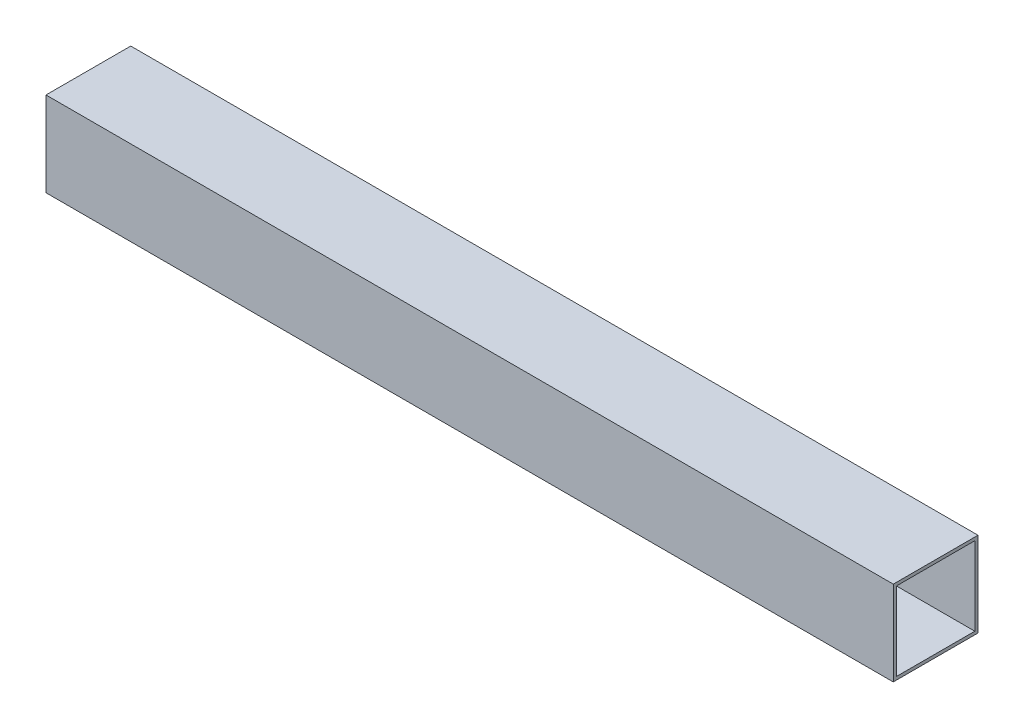
ISO-10303-21;
HEADER;
FILE_DESCRIPTION(('STEP AP214'),'2;1');
FILE_NAME('part.step','',(''),(''),'','','');
FILE_SCHEMA(('AUTOMOTIVE_DESIGN { 1 0 10303 214 1 1 1 1 }'));
ENDSEC;
DATA;
#1=APPLICATION_CONTEXT('core data for automotive mechanical design processes');
#2=APPLICATION_PROTOCOL_DEFINITION('international standard','automotive_design',2000,#1);
#3=PRODUCT_CONTEXT('',#1,'mechanical');
#4=PRODUCT('Part','Part','',(#3));
#5=PRODUCT_RELATED_PRODUCT_CATEGORY('part','',(#4));
#6=PRODUCT_DEFINITION_FORMATION('','',#4);
#7=PRODUCT_DEFINITION_CONTEXT('part definition',#1,'design');
#8=PRODUCT_DEFINITION('design','',#6,#7);
#9=PRODUCT_DEFINITION_SHAPE('','',#8);
#10=(LENGTH_UNIT() NAMED_UNIT(*) SI_UNIT(.MILLI.,.METRE.));
#11=(NAMED_UNIT(*) PLANE_ANGLE_UNIT() SI_UNIT($,.RADIAN.));
#12=(NAMED_UNIT(*) SI_UNIT($,.STERADIAN.) SOLID_ANGLE_UNIT());
#13=UNCERTAINTY_MEASURE_WITH_UNIT(LENGTH_MEASURE(1.E-05),#10,'distance_accuracy_value','');
#14=(GEOMETRIC_REPRESENTATION_CONTEXT(3) GLOBAL_UNCERTAINTY_ASSIGNED_CONTEXT((#13)) GLOBAL_UNIT_ASSIGNED_CONTEXT((#10,
#11,#12)) REPRESENTATION_CONTEXT('',''));
#15=CARTESIAN_POINT('',(0.,0.,0.));
#16=DIRECTION('',(0.,0.,1.));
#17=DIRECTION('',(1.,0.,0.));
#18=AXIS2_PLACEMENT_3D('',#15,#16,#17);
#19=CARTESIAN_POINT('',(400.,-20.,-20.));
#20=DIRECTION('',(0.,0.,1.));
#21=DIRECTION('',(1.,0.,0.));
#22=AXIS2_PLACEMENT_3D('',#19,#20,#21);
#23=PLANE('',#22);
#24=DIRECTION('',(0.,1.,0.));
#25=VECTOR('',#24,1.);
#26=CARTESIAN_POINT('',(0.,-20.,-20.));
#27=LINE('',#26,#25);
#28=CARTESIAN_POINT('',(0.,-20.,-20.));
#29=VERTEX_POINT('',#28);
#30=CARTESIAN_POINT('',(0.,20.,-20.));
#31=VERTEX_POINT('',#30);
#32=EDGE_CURVE('E147',#29,#31,#27,.T.);
#33=ORIENTED_EDGE('',*,*,#32,.T.);
#34=DIRECTION('',(-1.,0.,0.));
#35=VECTOR('',#34,1.);
#36=CARTESIAN_POINT('',(400.,20.,-20.));
#37=LINE('',#36,#35);
#38=CARTESIAN_POINT('',(400.,20.,-20.));
#39=VERTEX_POINT('',#38);
#40=EDGE_CURVE('E11',#39,#31,#37,.T.);
#41=ORIENTED_EDGE('',*,*,#40,.F.);
#42=DIRECTION('',(0.,1.,0.));
#43=VECTOR('',#42,1.);
#44=CARTESIAN_POINT('',(400.,-20.,-20.));
#45=LINE('',#44,#43);
#46=CARTESIAN_POINT('',(400.,-20.,-20.));
#47=VERTEX_POINT('',#46);
#48=EDGE_CURVE('E153',#47,#39,#45,.T.);
#49=ORIENTED_EDGE('',*,*,#48,.F.);
#50=DIRECTION('',(-1.,0.,0.));
#51=VECTOR('',#50,1.);
#52=CARTESIAN_POINT('',(400.,-20.,-20.));
#53=LINE('',#52,#51);
#54=EDGE_CURVE('E167',#47,#29,#53,.T.);
#55=ORIENTED_EDGE('',*,*,#54,.T.);
#56=EDGE_LOOP('',(#33,#41,#49,#55));
#57=FACE_BOUND('',#56,.T.);
#58=ADVANCED_FACE('F39',(#57),#23,.F.);
#59=CARTESIAN_POINT('',(400.,20.,20.));
#60=DIRECTION('',(0.,-1.,0.));
#61=DIRECTION('',(0.,0.,-1.));
#62=AXIS2_PLACEMENT_3D('',#59,#60,#61);
#63=PLANE('',#62);
#64=DIRECTION('',(0.,0.,1.));
#65=VECTOR('',#64,1.);
#66=CARTESIAN_POINT('',(0.,20.,20.));
#67=LINE('',#66,#65);
#68=CARTESIAN_POINT('',(0.,20.,20.));
#69=VERTEX_POINT('',#68);
#70=EDGE_CURVE('E171',#31,#69,#67,.T.);
#71=ORIENTED_EDGE('',*,*,#70,.T.);
#72=DIRECTION('',(-1.,0.,0.));
#73=VECTOR('',#72,1.);
#74=CARTESIAN_POINT('',(400.,20.,20.));
#75=LINE('',#74,#73);
#76=CARTESIAN_POINT('',(400.,20.,20.));
#77=VERTEX_POINT('',#76);
#78=EDGE_CURVE('E47',#77,#69,#75,.T.);
#79=ORIENTED_EDGE('',*,*,#78,.F.);
#80=DIRECTION('',(0.,0.,1.));
#81=VECTOR('',#80,1.);
#82=CARTESIAN_POINT('',(400.,20.,20.));
#83=LINE('',#82,#81);
#84=EDGE_CURVE('E157',#39,#77,#83,.T.);
#85=ORIENTED_EDGE('',*,*,#84,.F.);
#86=ORIENTED_EDGE('',*,*,#40,.T.);
#87=EDGE_LOOP('',(#71,#79,#85,#86));
#88=FACE_BOUND('',#87,.T.);
#89=ADVANCED_FACE('F205',(#88),#63,.F.);
#90=CARTESIAN_POINT('',(400.,-20.,20.));
#91=DIRECTION('',(0.,0.,-1.));
#92=DIRECTION('',(-1.,0.,0.));
#93=AXIS2_PLACEMENT_3D('',#90,#91,#92);
#94=PLANE('',#93);
#95=DIRECTION('',(0.,-1.,0.));
#96=VECTOR('',#95,1.);
#97=CARTESIAN_POINT('',(0.,-20.,20.));
#98=LINE('',#97,#96);
#99=CARTESIAN_POINT('',(0.,-20.,20.));
#100=VERTEX_POINT('',#99);
#101=EDGE_CURVE('E174',#69,#100,#98,.T.);
#102=ORIENTED_EDGE('',*,*,#101,.T.);
#103=DIRECTION('',(-1.,0.,0.));
#104=VECTOR('',#103,1.);
#105=CARTESIAN_POINT('',(400.,-20.,20.));
#106=LINE('',#105,#104);
#107=CARTESIAN_POINT('',(400.,-20.,20.));
#108=VERTEX_POINT('',#107);
#109=EDGE_CURVE('E182',#108,#100,#106,.T.);
#110=ORIENTED_EDGE('',*,*,#109,.F.);
#111=DIRECTION('',(0.,-1.,0.));
#112=VECTOR('',#111,1.);
#113=CARTESIAN_POINT('',(400.,-20.,20.));
#114=LINE('',#113,#112);
#115=EDGE_CURVE('E161',#77,#108,#114,.T.);
#116=ORIENTED_EDGE('',*,*,#115,.F.);
#117=ORIENTED_EDGE('',*,*,#78,.T.);
#118=EDGE_LOOP('',(#102,#110,#116,#117));
#119=FACE_BOUND('',#118,.T.);
#120=ADVANCED_FACE('F191',(#119),#94,.F.);
#121=CARTESIAN_POINT('',(400.,-20.,20.));
#122=DIRECTION('',(0.,1.,0.));
#123=DIRECTION('',(0.,0.,1.));
#124=AXIS2_PLACEMENT_3D('',#121,#122,#123);
#125=PLANE('',#124);
#126=DIRECTION('',(0.,0.,-1.));
#127=VECTOR('',#126,1.);
#128=CARTESIAN_POINT('',(0.,-20.,20.));
#129=LINE('',#128,#127);
#130=EDGE_CURVE('E158',#100,#29,#129,.T.);
#131=ORIENTED_EDGE('',*,*,#130,.T.);
#132=ORIENTED_EDGE('',*,*,#54,.F.);
#133=DIRECTION('',(0.,0.,-1.));
#134=VECTOR('',#133,1.);
#135=CARTESIAN_POINT('',(400.,-20.,20.));
#136=LINE('',#135,#134);
#137=EDGE_CURVE('E164',#108,#47,#136,.T.);
#138=ORIENTED_EDGE('',*,*,#137,.F.);
#139=ORIENTED_EDGE('',*,*,#109,.T.);
#140=EDGE_LOOP('',(#131,#132,#138,#139));
#141=FACE_BOUND('',#140,.T.);
#142=ADVANCED_FACE('F200',(#141),#125,.F.);
#143=CARTESIAN_POINT('',(400.,0.,0.));
#144=DIRECTION('',(-1.,0.,0.));
#145=DIRECTION('',(0.,0.,1.));
#146=AXIS2_PLACEMENT_3D('',#143,#144,#145);
#147=PLANE('',#146);
#148=DIRECTION('',(0.,0.,1.));
#149=VECTOR('',#148,1.);
#150=CARTESIAN_POINT('',(400.,-18.5,-18.5));
#151=LINE('',#150,#149);
#152=CARTESIAN_POINT('',(400.,-18.5,-18.5));
#153=VERTEX_POINT('',#152);
#154=CARTESIAN_POINT('',(400.,-18.5,18.5));
#155=VERTEX_POINT('',#154);
#156=EDGE_CURVE('E113',#153,#155,#151,.T.);
#157=ORIENTED_EDGE('',*,*,#156,.T.);
#158=DIRECTION('',(0.,1.,0.));
#159=VECTOR('',#158,1.);
#160=CARTESIAN_POINT('',(400.,-18.5,18.5));
#161=LINE('',#160,#159);
#162=CARTESIAN_POINT('',(400.,18.5,18.5));
#163=VERTEX_POINT('',#162);
#164=EDGE_CURVE('E106',#155,#163,#161,.T.);
#165=ORIENTED_EDGE('',*,*,#164,.T.);
#166=DIRECTION('',(0.,0.,-1.));
#167=VECTOR('',#166,1.);
#168=CARTESIAN_POINT('',(400.,18.5,-18.5));
#169=LINE('',#168,#167);
#170=CARTESIAN_POINT('',(400.,18.5,-18.5));
#171=VERTEX_POINT('',#170);
#172=EDGE_CURVE('E116',#163,#171,#169,.T.);
#173=ORIENTED_EDGE('',*,*,#172,.T.);
#174=DIRECTION('',(0.,-1.,0.));
#175=VECTOR('',#174,1.);
#176=CARTESIAN_POINT('',(400.,-18.5,-18.5));
#177=LINE('',#176,#175);
#178=EDGE_CURVE('E54',#171,#153,#177,.T.);
#179=ORIENTED_EDGE('',*,*,#178,.T.);
#180=EDGE_LOOP('',(#157,#165,#173,#179));
#181=FACE_BOUND('',#180,.T.);
#182=ORIENTED_EDGE('',*,*,#48,.T.);
#183=ORIENTED_EDGE('',*,*,#84,.T.);
#184=ORIENTED_EDGE('',*,*,#115,.T.);
#185=ORIENTED_EDGE('',*,*,#137,.T.);
#186=EDGE_LOOP('',(#182,#183,#184,#185));
#187=FACE_BOUND('',#186,.T.);
#188=ADVANCED_FACE('F121',(#181,#187),#147,.F.);
#189=CARTESIAN_POINT('',(0.,0.,0.));
#190=DIRECTION('',(-1.,0.,0.));
#191=DIRECTION('',(0.,0.,1.));
#192=AXIS2_PLACEMENT_3D('',#189,#190,#191);
#193=PLANE('',#192);
#194=DIRECTION('',(0.,1.,0.));
#195=VECTOR('',#194,1.);
#196=CARTESIAN_POINT('',(0.,-18.5,18.5));
#197=LINE('',#196,#195);
#198=CARTESIAN_POINT('',(0.,-18.5,18.5));
#199=VERTEX_POINT('',#198);
#200=CARTESIAN_POINT('',(0.,18.5,18.5));
#201=VERTEX_POINT('',#200);
#202=EDGE_CURVE('E62',#199,#201,#197,.T.);
#203=ORIENTED_EDGE('',*,*,#202,.F.);
#204=DIRECTION('',(0.,0.,1.));
#205=VECTOR('',#204,1.);
#206=CARTESIAN_POINT('',(0.,-18.5,-18.5));
#207=LINE('',#206,#205);
#208=CARTESIAN_POINT('',(0.,-18.5,-18.5));
#209=VERTEX_POINT('',#208);
#210=EDGE_CURVE('E125',#209,#199,#207,.T.);
#211=ORIENTED_EDGE('',*,*,#210,.F.);
#212=DIRECTION('',(0.,-1.,0.));
#213=VECTOR('',#212,1.);
#214=CARTESIAN_POINT('',(0.,-18.5,-18.5));
#215=LINE('',#214,#213);
#216=CARTESIAN_POINT('',(0.,18.5,-18.5));
#217=VERTEX_POINT('',#216);
#218=EDGE_CURVE('E129',#217,#209,#215,.T.);
#219=ORIENTED_EDGE('',*,*,#218,.F.);
#220=DIRECTION('',(0.,0.,-1.));
#221=VECTOR('',#220,1.);
#222=CARTESIAN_POINT('',(0.,18.5,-18.5));
#223=LINE('',#222,#221);
#224=EDGE_CURVE('E138',#201,#217,#223,.T.);
#225=ORIENTED_EDGE('',*,*,#224,.F.);
#226=EDGE_LOOP('',(#203,#211,#219,#225));
#227=FACE_BOUND('',#226,.T.);
#228=ORIENTED_EDGE('',*,*,#32,.F.);
#229=ORIENTED_EDGE('',*,*,#130,.F.);
#230=ORIENTED_EDGE('',*,*,#101,.F.);
#231=ORIENTED_EDGE('',*,*,#70,.F.);
#232=EDGE_LOOP('',(#228,#229,#230,#231));
#233=FACE_BOUND('',#232,.T.);
#234=ADVANCED_FACE('F197',(#227,#233),#193,.T.);
#235=CARTESIAN_POINT('',(400.,-18.5,18.5));
#236=DIRECTION('',(0.,0.,1.));
#237=DIRECTION('',(1.,0.,0.));
#238=AXIS2_PLACEMENT_3D('',#235,#236,#237);
#239=PLANE('',#238);
#240=ORIENTED_EDGE('',*,*,#202,.T.);
#241=DIRECTION('',(-1.,0.,0.));
#242=VECTOR('',#241,1.);
#243=CARTESIAN_POINT('',(400.,18.5,18.5));
#244=LINE('',#243,#242);
#245=EDGE_CURVE('E102',#163,#201,#244,.T.);
#246=ORIENTED_EDGE('',*,*,#245,.F.);
#247=ORIENTED_EDGE('',*,*,#164,.F.);
#248=DIRECTION('',(-1.,0.,0.));
#249=VECTOR('',#248,1.);
#250=CARTESIAN_POINT('',(400.,-18.5,18.5));
#251=LINE('',#250,#249);
#252=EDGE_CURVE('E144',#155,#199,#251,.T.);
#253=ORIENTED_EDGE('',*,*,#252,.T.);
#254=EDGE_LOOP('',(#240,#246,#247,#253));
#255=FACE_BOUND('',#254,.T.);
#256=ADVANCED_FACE('F104',(#255),#239,.F.);
#257=CARTESIAN_POINT('',(400.,-18.5,-18.5));
#258=DIRECTION('',(0.,-1.,0.));
#259=DIRECTION('',(0.,0.,-1.));
#260=AXIS2_PLACEMENT_3D('',#257,#258,#259);
#261=PLANE('',#260);
#262=ORIENTED_EDGE('',*,*,#210,.T.);
#263=ORIENTED_EDGE('',*,*,#252,.F.);
#264=ORIENTED_EDGE('',*,*,#156,.F.);
#265=DIRECTION('',(-1.,0.,0.));
#266=VECTOR('',#265,1.);
#267=CARTESIAN_POINT('',(400.,-18.5,-18.5));
#268=LINE('',#267,#266);
#269=EDGE_CURVE('E148',#153,#209,#268,.T.);
#270=ORIENTED_EDGE('',*,*,#269,.T.);
#271=EDGE_LOOP('',(#262,#263,#264,#270));
#272=FACE_BOUND('',#271,.T.);
#273=ADVANCED_FACE('F222',(#272),#261,.F.);
#274=CARTESIAN_POINT('',(400.,-18.5,-18.5));
#275=DIRECTION('',(0.,0.,-1.));
#276=DIRECTION('',(-1.,0.,0.));
#277=AXIS2_PLACEMENT_3D('',#274,#275,#276);
#278=PLANE('',#277);
#279=ORIENTED_EDGE('',*,*,#218,.T.);
#280=ORIENTED_EDGE('',*,*,#269,.F.);
#281=ORIENTED_EDGE('',*,*,#178,.F.);
#282=DIRECTION('',(-1.,0.,0.));
#283=VECTOR('',#282,1.);
#284=CARTESIAN_POINT('',(400.,18.5,-18.5));
#285=LINE('',#284,#283);
#286=EDGE_CURVE('E112',#171,#217,#285,.T.);
#287=ORIENTED_EDGE('',*,*,#286,.T.);
#288=EDGE_LOOP('',(#279,#280,#281,#287));
#289=FACE_BOUND('',#288,.T.);
#290=ADVANCED_FACE('F225',(#289),#278,.F.);
#291=CARTESIAN_POINT('',(400.,18.5,-18.5));
#292=DIRECTION('',(0.,1.,0.));
#293=DIRECTION('',(0.,0.,1.));
#294=AXIS2_PLACEMENT_3D('',#291,#292,#293);
#295=PLANE('',#294);
#296=ORIENTED_EDGE('',*,*,#224,.T.);
#297=ORIENTED_EDGE('',*,*,#286,.F.);
#298=ORIENTED_EDGE('',*,*,#172,.F.);
#299=ORIENTED_EDGE('',*,*,#245,.T.);
#300=EDGE_LOOP('',(#296,#297,#298,#299));
#301=FACE_BOUND('',#300,.T.);
#302=ADVANCED_FACE('F117',(#301),#295,.F.);
#303=CLOSED_SHELL('',(#58,#89,#120,#142,#188,#234,#256,#273,#290,#302));
#304=MANIFOLD_SOLID_BREP('B2',#303);
#305=ADVANCED_BREP_SHAPE_REPRESENTATION('',(#18,#304),#14);
#306=SHAPE_DEFINITION_REPRESENTATION(#9,#305);
ENDSEC;
END-ISO-10303-21;
